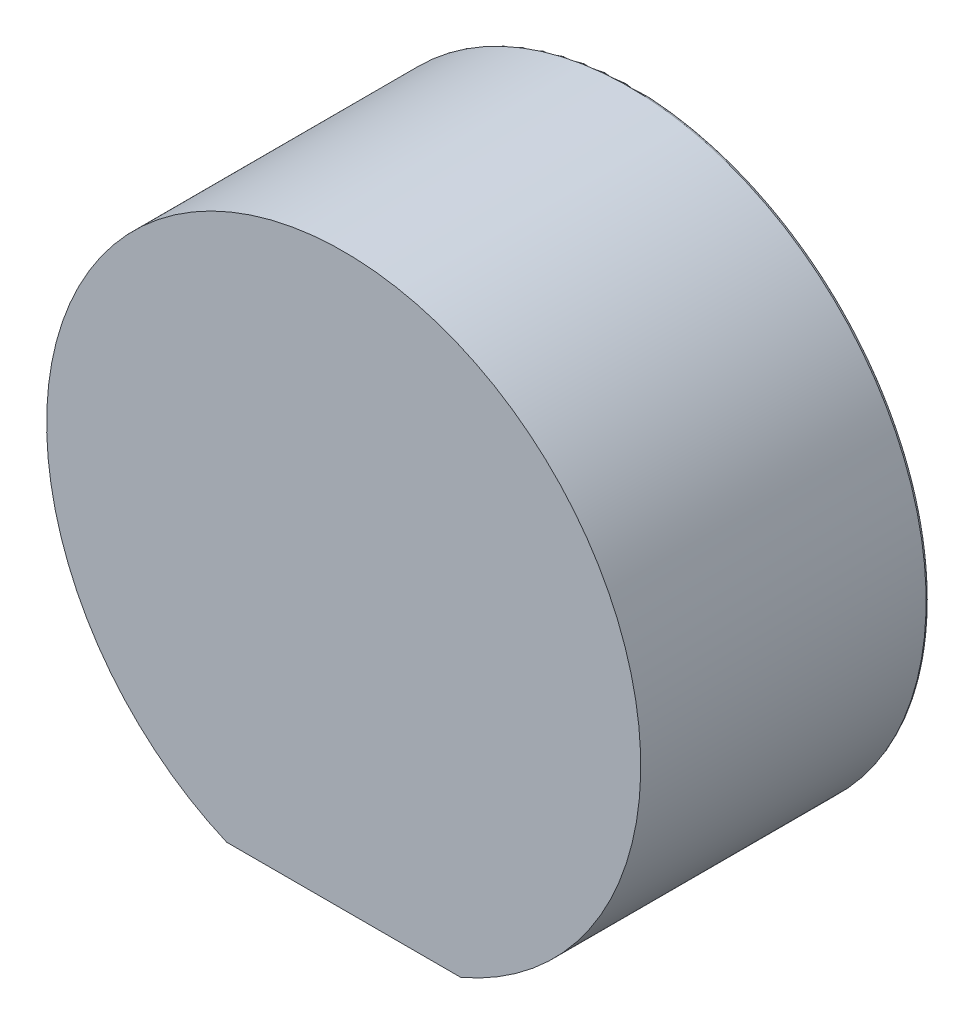
ISO-10303-21;
HEADER;
FILE_DESCRIPTION(('STEP AP214'),'2;1');
FILE_NAME('part.step','',(''),(''),'','','');
FILE_SCHEMA(('AUTOMOTIVE_DESIGN { 1 0 10303 214 1 1 1 1 }'));
ENDSEC;
DATA;
#1=APPLICATION_CONTEXT('core data for automotive mechanical design processes');
#2=APPLICATION_PROTOCOL_DEFINITION('international standard','automotive_design',2000,#1);
#3=PRODUCT_CONTEXT('',#1,'mechanical');
#4=PRODUCT('Part','Part','',(#3));
#5=PRODUCT_RELATED_PRODUCT_CATEGORY('part','',(#4));
#6=PRODUCT_DEFINITION_FORMATION('','',#4);
#7=PRODUCT_DEFINITION_CONTEXT('part definition',#1,'design');
#8=PRODUCT_DEFINITION('design','',#6,#7);
#9=PRODUCT_DEFINITION_SHAPE('','',#8);
#10=(LENGTH_UNIT() NAMED_UNIT(*) SI_UNIT(.MILLI.,.METRE.));
#11=(NAMED_UNIT(*) PLANE_ANGLE_UNIT() SI_UNIT($,.RADIAN.));
#12=(NAMED_UNIT(*) SI_UNIT($,.STERADIAN.) SOLID_ANGLE_UNIT());
#13=UNCERTAINTY_MEASURE_WITH_UNIT(LENGTH_MEASURE(1.E-05),#10,'distance_accuracy_value','');
#14=(GEOMETRIC_REPRESENTATION_CONTEXT(3) GLOBAL_UNCERTAINTY_ASSIGNED_CONTEXT((#13)) GLOBAL_UNIT_ASSIGNED_CONTEXT((#10,
#11,#12)) REPRESENTATION_CONTEXT('',''));
#15=CARTESIAN_POINT('',(0.,0.,0.));
#16=DIRECTION('',(0.,0.,1.));
#17=DIRECTION('',(1.,0.,0.));
#18=AXIS2_PLACEMENT_3D('',#15,#16,#17);
#19=CARTESIAN_POINT('',(0.,0.,-8.));
#20=DIRECTION('',(0.,0.,1.));
#21=DIRECTION('',(1.,0.,0.));
#22=AXIS2_PLACEMENT_3D('',#19,#20,#21);
#23=CYLINDRICAL_SURFACE('',#22,16.5);
#24=CARTESIAN_POINT('',(0.,0.,-15.85));
#25=DIRECTION('',(0.,0.,-1.));
#26=DIRECTION('',(-1.,0.,0.));
#27=AXIS2_PLACEMENT_3D('',#24,#25,#26);
#28=CIRCLE('',#27,16.5);
#29=CARTESIAN_POINT('',(-16.5,0.,-15.85));
#30=VERTEX_POINT('',#29);
#31=EDGE_CURVE('E11',#30,#30,#28,.F.);
#32=ORIENTED_EDGE('',*,*,#31,.T.);
#33=EDGE_LOOP('',(#32));
#34=FACE_BOUND('',#33,.T.);
#35=CARTESIAN_POINT('',(0.,0.,0.));
#36=DIRECTION('',(0.,0.,1.));
#37=DIRECTION('',(-1.,0.,0.));
#38=AXIS2_PLACEMENT_3D('',#35,#36,#37);
#39=CIRCLE('',#38,16.5);
#40=CARTESIAN_POINT('',(6.5,-15.1657508881031,0.));
#41=VERTEX_POINT('',#40);
#42=CARTESIAN_POINT('',(-6.5,-15.1657508881031,0.));
#43=VERTEX_POINT('',#42);
#44=EDGE_CURVE('E67',#41,#43,#39,.T.);
#45=ORIENTED_EDGE('',*,*,#44,.F.);
#46=DIRECTION('',(0.,0.,1.));
#47=VECTOR('',#46,1.);
#48=CARTESIAN_POINT('',(6.5,-15.1657508881031,-8.));
#49=LINE('',#48,#47);
#50=CARTESIAN_POINT('',(6.5,-15.1657508881031,-8.));
#51=VERTEX_POINT('',#50);
#52=EDGE_CURVE('E66',#51,#41,#49,.T.);
#53=ORIENTED_EDGE('',*,*,#52,.F.);
#54=CARTESIAN_POINT('',(0.,0.,-8.));
#55=DIRECTION('',(0.,0.,-1.));
#56=DIRECTION('',(-1.,0.,0.));
#57=AXIS2_PLACEMENT_3D('',#54,#55,#56);
#58=CIRCLE('',#57,16.5);
#59=CARTESIAN_POINT('',(-6.50000000000001,-15.1657508881031,-8.));
#60=VERTEX_POINT('',#59);
#61=EDGE_CURVE('E48',#51,#60,#58,.T.);
#62=ORIENTED_EDGE('',*,*,#61,.T.);
#63=DIRECTION('',(0.,0.,1.));
#64=VECTOR('',#63,1.);
#65=CARTESIAN_POINT('',(-6.5,-15.1657508881031,-8.));
#66=LINE('',#65,#64);
#67=EDGE_CURVE('E58',#60,#43,#66,.T.);
#68=ORIENTED_EDGE('',*,*,#67,.T.);
#69=EDGE_LOOP('',(#45,#53,#62,#68));
#70=FACE_BOUND('',#69,.T.);
#71=ADVANCED_FACE('F33',(#34,#70),#23,.T.);
#72=CARTESIAN_POINT('',(-6.5,-15.1657508881031,-8.));
#73=DIRECTION('',(0.,-1.,0.));
#74=DIRECTION('',(0.,0.,-1.));
#75=AXIS2_PLACEMENT_3D('',#72,#73,#74);
#76=PLANE('',#75);
#77=DIRECTION('',(1.,0.,0.));
#78=VECTOR('',#77,1.);
#79=CARTESIAN_POINT('',(-6.5,-15.1657508881031,0.));
#80=LINE('',#79,#78);
#81=EDGE_CURVE('E64',#43,#41,#80,.T.);
#82=ORIENTED_EDGE('',*,*,#81,.F.);
#83=ORIENTED_EDGE('',*,*,#67,.F.);
#84=DIRECTION('',(1.,0.,0.));
#85=VECTOR('',#84,1.);
#86=CARTESIAN_POINT('',(-6.5,-15.1657508881031,-8.));
#87=LINE('',#86,#85);
#88=EDGE_CURVE('E61',#60,#51,#87,.T.);
#89=ORIENTED_EDGE('',*,*,#88,.T.);
#90=ORIENTED_EDGE('',*,*,#52,.T.);
#91=EDGE_LOOP('',(#82,#83,#89,#90));
#92=FACE_BOUND('',#91,.T.);
#93=ADVANCED_FACE('F70',(#92),#76,.T.);
#94=CARTESIAN_POINT('',(0.,0.,0.));
#95=DIRECTION('',(0.,0.,-1.));
#96=DIRECTION('',(-1.,0.,0.));
#97=AXIS2_PLACEMENT_3D('',#94,#95,#96);
#98=PLANE('',#97);
#99=ORIENTED_EDGE('',*,*,#44,.T.);
#100=ORIENTED_EDGE('',*,*,#81,.T.);
#101=EDGE_LOOP('',(#99,#100));
#102=FACE_BOUND('',#101,.T.);
#103=ADVANCED_FACE('F97',(#102),#98,.F.);
#104=CARTESIAN_POINT('',(0.,0.,-16.));
#105=DIRECTION('',(0.,0.,-1.));
#106=DIRECTION('',(-1.,0.,0.));
#107=AXIS2_PLACEMENT_3D('',#104,#105,#106);
#108=PLANE('',#107);
#109=CARTESIAN_POINT('',(0.,0.,-16.));
#110=DIRECTION('',(0.,0.,-1.));
#111=DIRECTION('',(-1.,0.,0.));
#112=AXIS2_PLACEMENT_3D('',#109,#110,#111);
#113=CIRCLE('',#112,16.35);
#114=CARTESIAN_POINT('',(-16.35,0.,-16.));
#115=VERTEX_POINT('',#114);
#116=EDGE_CURVE('E42',#115,#115,#113,.T.);
#117=ORIENTED_EDGE('',*,*,#116,.T.);
#118=EDGE_LOOP('',(#117));
#119=FACE_BOUND('',#118,.T.);
#120=ADVANCED_FACE('F81',(#119),#108,.T.);
#121=CARTESIAN_POINT('',(0.,0.,-8.));
#122=DIRECTION('',(0.,0.,-1.));
#123=DIRECTION('',(-1.,0.,0.));
#124=AXIS2_PLACEMENT_3D('',#121,#122,#123);
#125=PLANE('',#124);
#126=ORIENTED_EDGE('',*,*,#88,.F.);
#127=ORIENTED_EDGE('',*,*,#61,.F.);
#128=EDGE_LOOP('',(#126,#127));
#129=FACE_BOUND('',#128,.T.);
#130=ADVANCED_FACE('F62',(#129),#125,.F.);
#131=CARTESIAN_POINT('',(0.,0.,-15.85));
#132=DIRECTION('',(0.,0.,-1.));
#133=DIRECTION('',(-1.,0.,0.));
#134=AXIS2_PLACEMENT_3D('',#131,#132,#133);
#135=TOROIDAL_SURFACE('',#134,16.35,0.15);
#136=ORIENTED_EDGE('',*,*,#31,.F.);
#137=EDGE_LOOP('',(#136));
#138=FACE_BOUND('',#137,.T.);
#139=ORIENTED_EDGE('',*,*,#116,.F.);
#140=EDGE_LOOP('',(#139));
#141=FACE_BOUND('',#140,.T.);
#142=ADVANCED_FACE('F35',(#138,#141),#135,.T.);
#143=CLOSED_SHELL('',(#71,#93,#103,#120,#130,#142));
#144=MANIFOLD_SOLID_BREP('B2',#143);
#145=ADVANCED_BREP_SHAPE_REPRESENTATION('',(#18,#144),#14);
#146=SHAPE_DEFINITION_REPRESENTATION(#9,#145);
ENDSEC;
END-ISO-10303-21;
